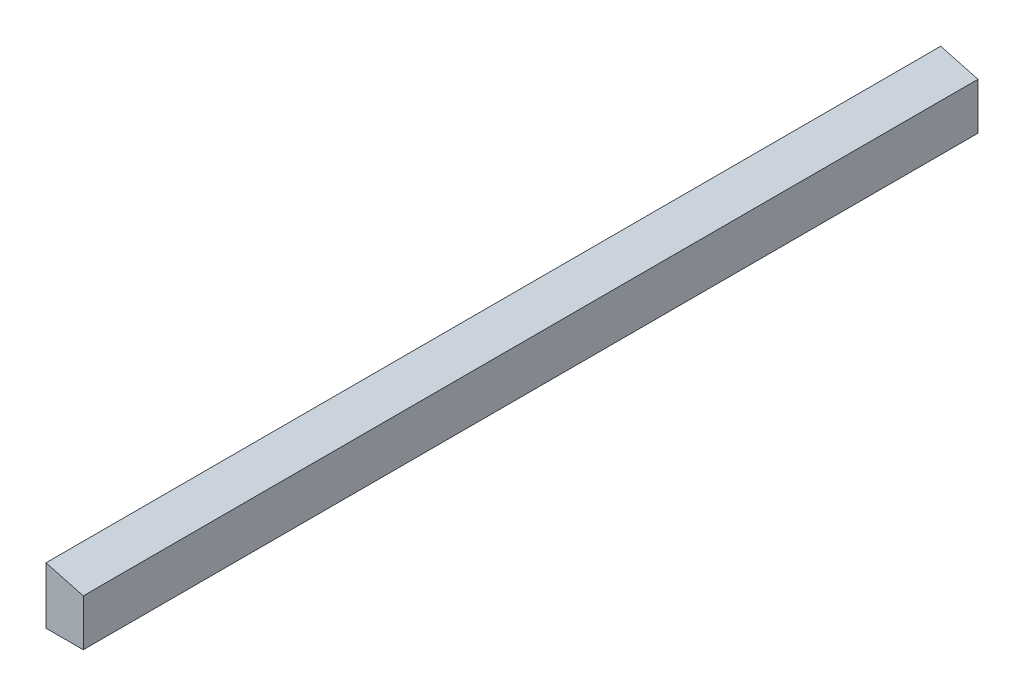
ISO-10303-21;
HEADER;
FILE_DESCRIPTION(('STEP AP214'),'2;1');
FILE_NAME('part.step','',(''),(''),'','','');
FILE_SCHEMA(('AUTOMOTIVE_DESIGN { 1 0 10303 214 1 1 1 1 }'));
ENDSEC;
DATA;
#1=APPLICATION_CONTEXT('core data for automotive mechanical design processes');
#2=APPLICATION_PROTOCOL_DEFINITION('international standard','automotive_design',2000,#1);
#3=PRODUCT_CONTEXT('',#1,'mechanical');
#4=PRODUCT('Part','Part','',(#3));
#5=PRODUCT_RELATED_PRODUCT_CATEGORY('part','',(#4));
#6=PRODUCT_DEFINITION_FORMATION('','',#4);
#7=PRODUCT_DEFINITION_CONTEXT('part definition',#1,'design');
#8=PRODUCT_DEFINITION('design','',#6,#7);
#9=PRODUCT_DEFINITION_SHAPE('','',#8);
#10=(LENGTH_UNIT() NAMED_UNIT(*) SI_UNIT(.MILLI.,.METRE.));
#11=(NAMED_UNIT(*) PLANE_ANGLE_UNIT() SI_UNIT($,.RADIAN.));
#12=(NAMED_UNIT(*) SI_UNIT($,.STERADIAN.) SOLID_ANGLE_UNIT());
#13=UNCERTAINTY_MEASURE_WITH_UNIT(LENGTH_MEASURE(1.E-05),#10,'distance_accuracy_value','');
#14=(GEOMETRIC_REPRESENTATION_CONTEXT(3) GLOBAL_UNCERTAINTY_ASSIGNED_CONTEXT((#13)) GLOBAL_UNIT_ASSIGNED_CONTEXT((#10,
#11,#12)) REPRESENTATION_CONTEXT('',''));
#15=CARTESIAN_POINT('',(0.,0.,0.));
#16=DIRECTION('',(0.,0.,1.));
#17=DIRECTION('',(1.,0.,0.));
#18=AXIS2_PLACEMENT_3D('',#15,#16,#17);
#19=CARTESIAN_POINT('',(-15.082688166558,35.2895591843776,914.4));
#20=DIRECTION('',(1.,0.,0.));
#21=DIRECTION('',(0.,1.,0.));
#22=AXIS2_PLACEMENT_3D('',#19,#20,#21);
#23=PLANE('',#22);
#24=DIRECTION('',(0.,-1.,0.));
#25=VECTOR('',#24,1.);
#26=CARTESIAN_POINT('',(-15.082688166558,35.2895591843776,0.));
#27=LINE('',#26,#25);
#28=CARTESIAN_POINT('',(-15.082688166558,35.2895591843776,0.));
#29=VERTEX_POINT('',#28);
#30=CARTESIAN_POINT('',(-15.082688166558,-22.6541908156224,0.));
#31=VERTEX_POINT('',#30);
#32=EDGE_CURVE('E95',#29,#31,#27,.T.);
#33=ORIENTED_EDGE('',*,*,#32,.T.);
#34=DIRECTION('',(0.,0.,-1.));
#35=VECTOR('',#34,1.);
#36=CARTESIAN_POINT('',(-15.082688166558,-22.6541908156224,914.4));
#37=LINE('',#36,#35);
#38=CARTESIAN_POINT('',(-15.082688166558,-22.6541908156224,914.4));
#39=VERTEX_POINT('',#38);
#40=EDGE_CURVE('E11',#39,#31,#37,.T.);
#41=ORIENTED_EDGE('',*,*,#40,.F.);
#42=DIRECTION('',(0.,-1.,0.));
#43=VECTOR('',#42,1.);
#44=CARTESIAN_POINT('',(-15.082688166558,35.2895591843776,914.4));
#45=LINE('',#44,#43);
#46=CARTESIAN_POINT('',(-15.082688166558,35.2895591843776,914.4));
#47=VERTEX_POINT('',#46);
#48=EDGE_CURVE('E83',#47,#39,#45,.T.);
#49=ORIENTED_EDGE('',*,*,#48,.F.);
#50=DIRECTION('',(0.,0.,-1.));
#51=VECTOR('',#50,1.);
#52=CARTESIAN_POINT('',(-15.082688166558,35.2895591843776,914.4));
#53=LINE('',#52,#51);
#54=EDGE_CURVE('E91',#47,#29,#53,.T.);
#55=ORIENTED_EDGE('',*,*,#54,.T.);
#56=EDGE_LOOP('',(#33,#41,#49,#55));
#57=FACE_BOUND('',#56,.T.);
#58=ADVANCED_FACE('F32',(#57),#23,.F.);
#59=CARTESIAN_POINT('',(-15.082688166558,-22.6541908156224,914.4));
#60=DIRECTION('',(0.,1.,0.));
#61=DIRECTION('',(0.,0.,1.));
#62=AXIS2_PLACEMENT_3D('',#59,#60,#61);
#63=PLANE('',#62);
#64=DIRECTION('',(1.,0.,0.));
#65=VECTOR('',#64,1.);
#66=CARTESIAN_POINT('',(-15.082688166558,-22.6541908156224,0.));
#67=LINE('',#66,#65);
#68=CARTESIAN_POINT('',(23.017311833442,-22.6541908156224,0.));
#69=VERTEX_POINT('',#68);
#70=EDGE_CURVE('E87',#31,#69,#67,.T.);
#71=ORIENTED_EDGE('',*,*,#70,.T.);
#72=DIRECTION('',(0.,0.,-1.));
#73=VECTOR('',#72,1.);
#74=CARTESIAN_POINT('',(23.017311833442,-22.6541908156224,914.4));
#75=LINE('',#74,#73);
#76=CARTESIAN_POINT('',(23.017311833442,-22.6541908156224,914.4));
#77=VERTEX_POINT('',#76);
#78=EDGE_CURVE('E40',#77,#69,#75,.T.);
#79=ORIENTED_EDGE('',*,*,#78,.F.);
#80=DIRECTION('',(1.,0.,0.));
#81=VECTOR('',#80,1.);
#82=CARTESIAN_POINT('',(-15.082688166558,-22.6541908156224,914.4));
#83=LINE('',#82,#81);
#84=EDGE_CURVE('E78',#39,#77,#83,.T.);
#85=ORIENTED_EDGE('',*,*,#84,.F.);
#86=ORIENTED_EDGE('',*,*,#40,.T.);
#87=EDGE_LOOP('',(#71,#79,#85,#86));
#88=FACE_BOUND('',#87,.T.);
#89=ADVANCED_FACE('F86',(#88),#63,.F.);
#90=CARTESIAN_POINT('',(23.017311833442,25.080694952752,914.4));
#91=DIRECTION('',(-1.,0.,0.));
#92=DIRECTION('',(0.,-1.,0.));
#93=AXIS2_PLACEMENT_3D('',#90,#91,#92);
#94=PLANE('',#93);
#95=DIRECTION('',(0.,1.,0.));
#96=VECTOR('',#95,1.);
#97=CARTESIAN_POINT('',(23.017311833442,25.080694952752,0.));
#98=LINE('',#97,#96);
#99=CARTESIAN_POINT('',(23.017311833442,25.080694952752,0.));
#100=VERTEX_POINT('',#99);
#101=EDGE_CURVE('E65',#69,#100,#98,.T.);
#102=ORIENTED_EDGE('',*,*,#101,.T.);
#103=DIRECTION('',(0.,0.,-1.));
#104=VECTOR('',#103,1.);
#105=CARTESIAN_POINT('',(23.017311833442,25.080694952752,914.4));
#106=LINE('',#105,#104);
#107=CARTESIAN_POINT('',(23.017311833442,25.080694952752,914.4));
#108=VERTEX_POINT('',#107);
#109=EDGE_CURVE('E88',#108,#100,#106,.T.);
#110=ORIENTED_EDGE('',*,*,#109,.F.);
#111=DIRECTION('',(0.,1.,0.));
#112=VECTOR('',#111,1.);
#113=CARTESIAN_POINT('',(23.017311833442,25.080694952752,914.4));
#114=LINE('',#113,#112);
#115=EDGE_CURVE('E81',#77,#108,#114,.T.);
#116=ORIENTED_EDGE('',*,*,#115,.F.);
#117=ORIENTED_EDGE('',*,*,#78,.T.);
#118=EDGE_LOOP('',(#102,#110,#116,#117));
#119=FACE_BOUND('',#118,.T.);
#120=ADVANCED_FACE('F89',(#119),#94,.F.);
#121=CARTESIAN_POINT('',(-15.082688166558,35.2895591843776,914.4));
#122=DIRECTION('',(-0.258819045102518,-0.965925826289069,0.));
#123=DIRECTION('',(0.965925826289069,-0.258819045102518,0.));
#124=AXIS2_PLACEMENT_3D('',#121,#122,#123);
#125=PLANE('',#124);
#126=DIRECTION('',(-0.965925826289069,0.258819045102518,0.));
#127=VECTOR('',#126,1.);
#128=CARTESIAN_POINT('',(-15.082688166558,35.2895591843776,0.));
#129=LINE('',#128,#127);
#130=EDGE_CURVE('E71',#100,#29,#129,.T.);
#131=ORIENTED_EDGE('',*,*,#130,.T.);
#132=ORIENTED_EDGE('',*,*,#54,.F.);
#133=DIRECTION('',(-0.965925826289069,0.258819045102518,0.));
#134=VECTOR('',#133,1.);
#135=CARTESIAN_POINT('',(-15.082688166558,35.2895591843776,914.4));
#136=LINE('',#135,#134);
#137=EDGE_CURVE('E48',#108,#47,#136,.T.);
#138=ORIENTED_EDGE('',*,*,#137,.F.);
#139=ORIENTED_EDGE('',*,*,#109,.T.);
#140=EDGE_LOOP('',(#131,#132,#138,#139));
#141=FACE_BOUND('',#140,.T.);
#142=ADVANCED_FACE('F102',(#141),#125,.F.);
#143=CARTESIAN_POINT('',(0.,0.,914.4));
#144=DIRECTION('',(0.,0.,1.));
#145=DIRECTION('',(1.,0.,0.));
#146=AXIS2_PLACEMENT_3D('',#143,#144,#145);
#147=PLANE('',#146);
#148=ORIENTED_EDGE('',*,*,#48,.T.);
#149=ORIENTED_EDGE('',*,*,#84,.T.);
#150=ORIENTED_EDGE('',*,*,#115,.T.);
#151=ORIENTED_EDGE('',*,*,#137,.T.);
#152=EDGE_LOOP('',(#148,#149,#150,#151));
#153=FACE_BOUND('',#152,.T.);
#154=ADVANCED_FACE('F79',(#153),#147,.T.);
#155=CARTESIAN_POINT('',(0.,0.,0.));
#156=DIRECTION('',(0.,0.,1.));
#157=DIRECTION('',(1.,0.,0.));
#158=AXIS2_PLACEMENT_3D('',#155,#156,#157);
#159=PLANE('',#158);
#160=ORIENTED_EDGE('',*,*,#32,.F.);
#161=ORIENTED_EDGE('',*,*,#130,.F.);
#162=ORIENTED_EDGE('',*,*,#101,.F.);
#163=ORIENTED_EDGE('',*,*,#70,.F.);
#164=EDGE_LOOP('',(#160,#161,#162,#163));
#165=FACE_BOUND('',#164,.T.);
#166=ADVANCED_FACE('F105',(#165),#159,.F.);
#167=CLOSED_SHELL('',(#58,#89,#120,#142,#154,#166));
#168=MANIFOLD_SOLID_BREP('B2',#167);
#169=ADVANCED_BREP_SHAPE_REPRESENTATION('',(#18,#168),#14);
#170=SHAPE_DEFINITION_REPRESENTATION(#9,#169);
ENDSEC;
END-ISO-10303-21;
